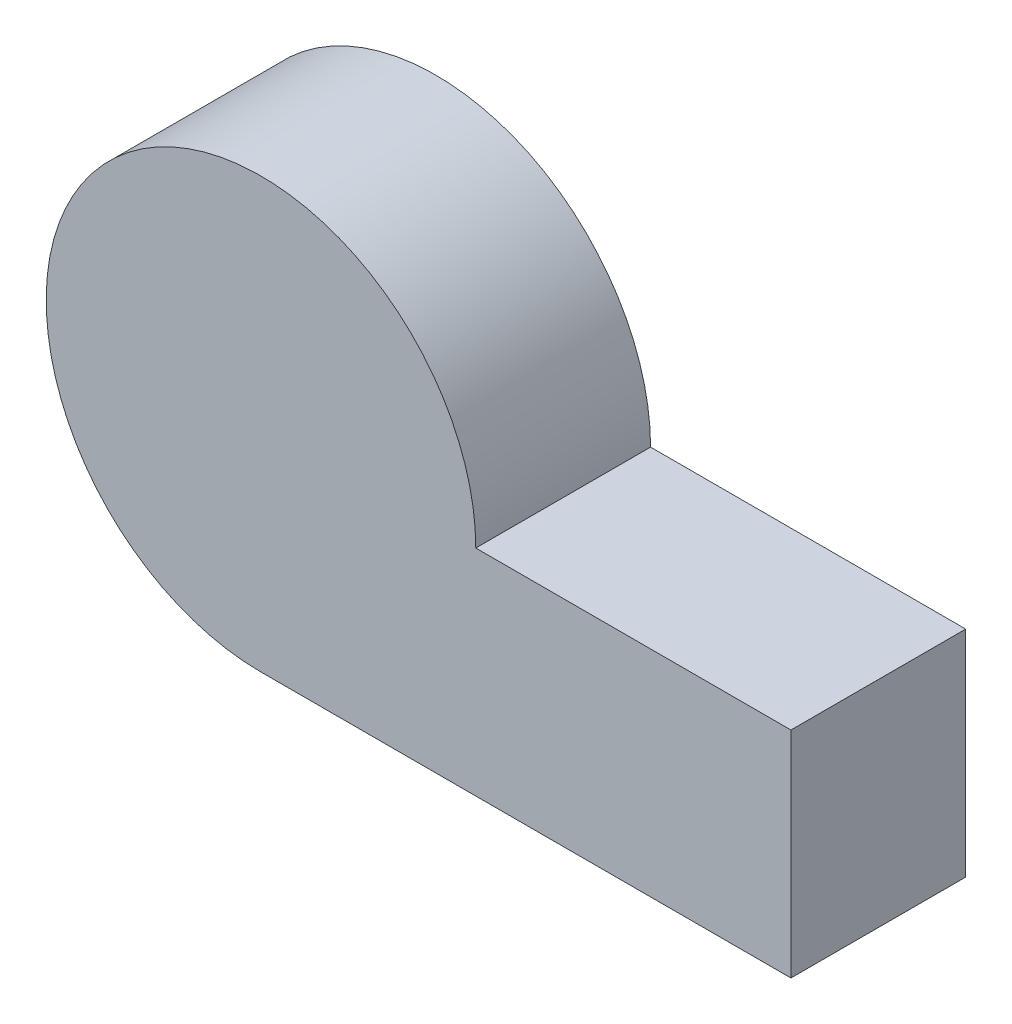
ISO-10303-21;
HEADER;
FILE_DESCRIPTION(('STEP AP214'),'2;1');
FILE_NAME('part.step','',(''),(''),'','','');
FILE_SCHEMA(('AUTOMOTIVE_DESIGN { 1 0 10303 214 1 1 1 1 }'));
ENDSEC;
DATA;
#1=APPLICATION_CONTEXT('core data for automotive mechanical design processes');
#2=APPLICATION_PROTOCOL_DEFINITION('international standard','automotive_design',2000,#1);
#3=PRODUCT_CONTEXT('',#1,'mechanical');
#4=PRODUCT('Part','Part','',(#3));
#5=PRODUCT_RELATED_PRODUCT_CATEGORY('part','',(#4));
#6=PRODUCT_DEFINITION_FORMATION('','',#4);
#7=PRODUCT_DEFINITION_CONTEXT('part definition',#1,'design');
#8=PRODUCT_DEFINITION('design','',#6,#7);
#9=PRODUCT_DEFINITION_SHAPE('','',#8);
#10=(LENGTH_UNIT() NAMED_UNIT(*) SI_UNIT(.MILLI.,.METRE.));
#11=(NAMED_UNIT(*) PLANE_ANGLE_UNIT() SI_UNIT($,.RADIAN.));
#12=(NAMED_UNIT(*) SI_UNIT($,.STERADIAN.) SOLID_ANGLE_UNIT());
#13=UNCERTAINTY_MEASURE_WITH_UNIT(LENGTH_MEASURE(1.E-05),#10,'distance_accuracy_value','');
#14=(GEOMETRIC_REPRESENTATION_CONTEXT(3) GLOBAL_UNCERTAINTY_ASSIGNED_CONTEXT((#13)) GLOBAL_UNIT_ASSIGNED_CONTEXT((#10,
#11,#12)) REPRESENTATION_CONTEXT('',''));
#15=CARTESIAN_POINT('',(0.,0.,0.));
#16=DIRECTION('',(0.,0.,1.));
#17=DIRECTION('',(1.,0.,0.));
#18=AXIS2_PLACEMENT_3D('',#15,#16,#17);
#19=CARTESIAN_POINT('',(0.,33.1794965157306,27.));
#20=DIRECTION('',(0.,0.,-1.));
#21=DIRECTION('',(-1.,0.,0.));
#22=AXIS2_PLACEMENT_3D('',#19,#20,#21);
#23=CYLINDRICAL_SURFACE('',#22,33.1794965157306);
#24=CARTESIAN_POINT('',(0.,33.1794965157306,0.));
#25=DIRECTION('',(0.,0.,1.));
#26=DIRECTION('',(1.,0.,0.));
#27=AXIS2_PLACEMENT_3D('',#24,#25,#26);
#28=CIRCLE('',#27,33.1794965157306);
#29=CARTESIAN_POINT('',(33.1794965157306,33.1794965157306,0.));
#30=VERTEX_POINT('',#29);
#31=CARTESIAN_POINT('',(0.,0.,0.));
#32=VERTEX_POINT('',#31);
#33=EDGE_CURVE('E96',#30,#32,#28,.T.);
#34=ORIENTED_EDGE('',*,*,#33,.T.);
#35=DIRECTION('',(0.,0.,-1.));
#36=VECTOR('',#35,1.);
#37=CARTESIAN_POINT('',(0.,0.,27.));
#38=LINE('',#37,#36);
#39=CARTESIAN_POINT('',(0.,0.,27.));
#40=VERTEX_POINT('',#39);
#41=EDGE_CURVE('E11',#40,#32,#38,.T.);
#42=ORIENTED_EDGE('',*,*,#41,.F.);
#43=CARTESIAN_POINT('',(0.,33.1794965157306,27.));
#44=DIRECTION('',(0.,0.,1.));
#45=DIRECTION('',(1.,0.,0.));
#46=AXIS2_PLACEMENT_3D('',#43,#44,#45);
#47=CIRCLE('',#46,33.1794965157306);
#48=CARTESIAN_POINT('',(33.1794965157306,33.1794965157306,27.));
#49=VERTEX_POINT('',#48);
#50=EDGE_CURVE('E84',#49,#40,#47,.T.);
#51=ORIENTED_EDGE('',*,*,#50,.F.);
#52=DIRECTION('',(0.,0.,-1.));
#53=VECTOR('',#52,1.);
#54=CARTESIAN_POINT('',(33.1794965157306,33.1794965157306,27.));
#55=LINE('',#54,#53);
#56=EDGE_CURVE('E92',#49,#30,#55,.T.);
#57=ORIENTED_EDGE('',*,*,#56,.T.);
#58=EDGE_LOOP('',(#34,#42,#51,#57));
#59=FACE_BOUND('',#58,.T.);
#60=ADVANCED_FACE('F33',(#59),#23,.T.);
#61=CARTESIAN_POINT('',(0.,0.,27.));
#62=DIRECTION('',(0.,1.,0.));
#63=DIRECTION('',(0.,0.,1.));
#64=AXIS2_PLACEMENT_3D('',#61,#62,#63);
#65=PLANE('',#64);
#66=DIRECTION('',(1.,0.,0.));
#67=VECTOR('',#66,1.);
#68=CARTESIAN_POINT('',(0.,0.,0.));
#69=LINE('',#68,#67);
#70=CARTESIAN_POINT('',(81.8615772765803,0.,0.));
#71=VERTEX_POINT('',#70);
#72=EDGE_CURVE('E88',#32,#71,#69,.T.);
#73=ORIENTED_EDGE('',*,*,#72,.T.);
#74=DIRECTION('',(0.,0.,-1.));
#75=VECTOR('',#74,1.);
#76=CARTESIAN_POINT('',(81.8615772765803,0.,27.));
#77=LINE('',#76,#75);
#78=CARTESIAN_POINT('',(81.8615772765803,0.,27.));
#79=VERTEX_POINT('',#78);
#80=EDGE_CURVE('E41',#79,#71,#77,.T.);
#81=ORIENTED_EDGE('',*,*,#80,.F.);
#82=DIRECTION('',(1.,0.,0.));
#83=VECTOR('',#82,1.);
#84=CARTESIAN_POINT('',(0.,0.,27.));
#85=LINE('',#84,#83);
#86=EDGE_CURVE('E79',#40,#79,#85,.T.);
#87=ORIENTED_EDGE('',*,*,#86,.F.);
#88=ORIENTED_EDGE('',*,*,#41,.T.);
#89=EDGE_LOOP('',(#73,#81,#87,#88));
#90=FACE_BOUND('',#89,.T.);
#91=ADVANCED_FACE('F87',(#90),#65,.F.);
#92=CARTESIAN_POINT('',(81.8615772765803,0.,27.));
#93=DIRECTION('',(-1.,0.,0.));
#94=DIRECTION('',(0.,0.,1.));
#95=AXIS2_PLACEMENT_3D('',#92,#93,#94);
#96=PLANE('',#95);
#97=DIRECTION('',(0.,1.,0.));
#98=VECTOR('',#97,1.);
#99=CARTESIAN_POINT('',(81.8615772765803,0.,0.));
#100=LINE('',#99,#98);
#101=CARTESIAN_POINT('',(81.8615772765803,33.1794965157306,0.));
#102=VERTEX_POINT('',#101);
#103=EDGE_CURVE('E66',#71,#102,#100,.T.);
#104=ORIENTED_EDGE('',*,*,#103,.T.);
#105=DIRECTION('',(0.,0.,-1.));
#106=VECTOR('',#105,1.);
#107=CARTESIAN_POINT('',(81.8615772765803,33.1794965157306,27.));
#108=LINE('',#107,#106);
#109=CARTESIAN_POINT('',(81.8615772765803,33.1794965157306,27.));
#110=VERTEX_POINT('',#109);
#111=EDGE_CURVE('E89',#110,#102,#108,.T.);
#112=ORIENTED_EDGE('',*,*,#111,.F.);
#113=DIRECTION('',(0.,1.,0.));
#114=VECTOR('',#113,1.);
#115=CARTESIAN_POINT('',(81.8615772765803,0.,27.));
#116=LINE('',#115,#114);
#117=EDGE_CURVE('E82',#79,#110,#116,.T.);
#118=ORIENTED_EDGE('',*,*,#117,.F.);
#119=ORIENTED_EDGE('',*,*,#80,.T.);
#120=EDGE_LOOP('',(#104,#112,#118,#119));
#121=FACE_BOUND('',#120,.T.);
#122=ADVANCED_FACE('F90',(#121),#96,.F.);
#123=CARTESIAN_POINT('',(33.1794965157306,33.1794965157306,27.));
#124=DIRECTION('',(0.,-1.,0.));
#125=DIRECTION('',(0.,0.,-1.));
#126=AXIS2_PLACEMENT_3D('',#123,#124,#125);
#127=PLANE('',#126);
#128=DIRECTION('',(-1.,0.,0.));
#129=VECTOR('',#128,1.);
#130=CARTESIAN_POINT('',(33.1794965157306,33.1794965157306,0.));
#131=LINE('',#130,#129);
#132=EDGE_CURVE('E72',#102,#30,#131,.T.);
#133=ORIENTED_EDGE('',*,*,#132,.T.);
#134=ORIENTED_EDGE('',*,*,#56,.F.);
#135=DIRECTION('',(-1.,0.,0.));
#136=VECTOR('',#135,1.);
#137=CARTESIAN_POINT('',(33.1794965157306,33.1794965157306,27.));
#138=LINE('',#137,#136);
#139=EDGE_CURVE('E49',#110,#49,#138,.T.);
#140=ORIENTED_EDGE('',*,*,#139,.F.);
#141=ORIENTED_EDGE('',*,*,#111,.T.);
#142=EDGE_LOOP('',(#133,#134,#140,#141));
#143=FACE_BOUND('',#142,.T.);
#144=ADVANCED_FACE('F103',(#143),#127,.F.);
#145=CARTESIAN_POINT('',(0.,33.1794965157306,27.));
#146=DIRECTION('',(0.,0.,1.));
#147=DIRECTION('',(1.,0.,0.));
#148=AXIS2_PLACEMENT_3D('',#145,#146,#147);
#149=PLANE('',#148);
#150=ORIENTED_EDGE('',*,*,#50,.T.);
#151=ORIENTED_EDGE('',*,*,#86,.T.);
#152=ORIENTED_EDGE('',*,*,#117,.T.);
#153=ORIENTED_EDGE('',*,*,#139,.T.);
#154=EDGE_LOOP('',(#150,#151,#152,#153));
#155=FACE_BOUND('',#154,.T.);
#156=ADVANCED_FACE('F80',(#155),#149,.T.);
#157=CARTESIAN_POINT('',(0.,33.1794965157306,0.));
#158=DIRECTION('',(0.,0.,1.));
#159=DIRECTION('',(1.,0.,0.));
#160=AXIS2_PLACEMENT_3D('',#157,#158,#159);
#161=PLANE('',#160);
#162=ORIENTED_EDGE('',*,*,#33,.F.);
#163=ORIENTED_EDGE('',*,*,#132,.F.);
#164=ORIENTED_EDGE('',*,*,#103,.F.);
#165=ORIENTED_EDGE('',*,*,#72,.F.);
#166=EDGE_LOOP('',(#162,#163,#164,#165));
#167=FACE_BOUND('',#166,.T.);
#168=ADVANCED_FACE('F106',(#167),#161,.F.);
#169=CLOSED_SHELL('',(#60,#91,#122,#144,#156,#168));
#170=MANIFOLD_SOLID_BREP('B2',#169);
#171=ADVANCED_BREP_SHAPE_REPRESENTATION('',(#18,#170),#14);
#172=SHAPE_DEFINITION_REPRESENTATION(#9,#171);
ENDSEC;
END-ISO-10303-21;
